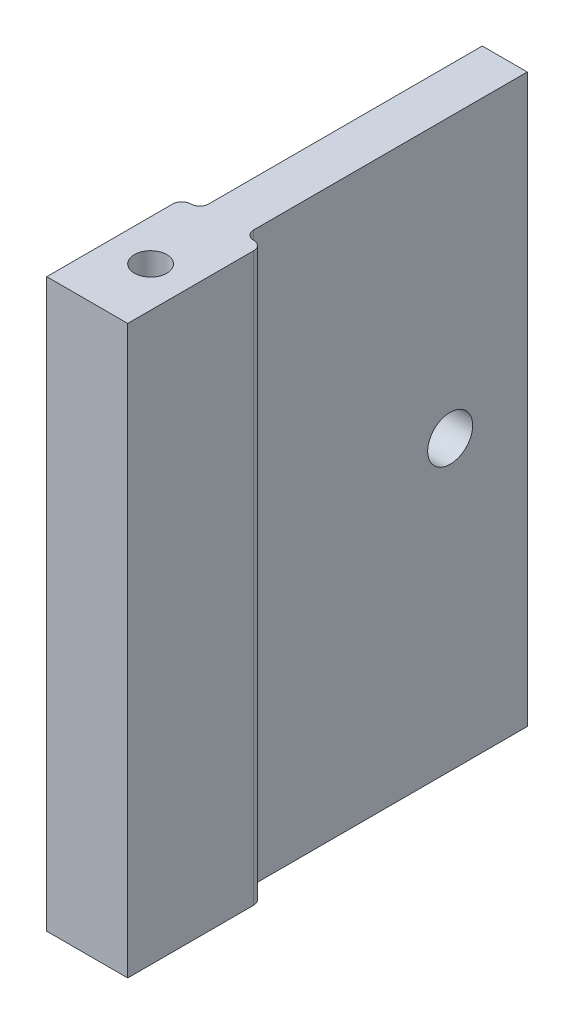
ISO-10303-21;
HEADER;
FILE_DESCRIPTION(('STEP AP214'),'2;1');
FILE_NAME('part.step','',(''),(''),'','','');
FILE_SCHEMA(('AUTOMOTIVE_DESIGN { 1 0 10303 214 1 1 1 1 }'));
ENDSEC;
DATA;
#1=APPLICATION_CONTEXT('core data for automotive mechanical design processes');
#2=APPLICATION_PROTOCOL_DEFINITION('international standard','automotive_design',2000,#1);
#3=PRODUCT_CONTEXT('',#1,'mechanical');
#4=PRODUCT('Part','Part','',(#3));
#5=PRODUCT_RELATED_PRODUCT_CATEGORY('part','',(#4));
#6=PRODUCT_DEFINITION_FORMATION('','',#4);
#7=PRODUCT_DEFINITION_CONTEXT('part definition',#1,'design');
#8=PRODUCT_DEFINITION('design','',#6,#7);
#9=PRODUCT_DEFINITION_SHAPE('','',#8);
#10=(LENGTH_UNIT() NAMED_UNIT(*) SI_UNIT(.MILLI.,.METRE.));
#11=(NAMED_UNIT(*) PLANE_ANGLE_UNIT() SI_UNIT($,.RADIAN.));
#12=(NAMED_UNIT(*) SI_UNIT($,.STERADIAN.) SOLID_ANGLE_UNIT());
#13=UNCERTAINTY_MEASURE_WITH_UNIT(LENGTH_MEASURE(1.E-05),#10,'distance_accuracy_value','');
#14=(GEOMETRIC_REPRESENTATION_CONTEXT(3) GLOBAL_UNCERTAINTY_ASSIGNED_CONTEXT((#13)) GLOBAL_UNIT_ASSIGNED_CONTEXT((#10,
#11,#12)) REPRESENTATION_CONTEXT('',''));
#15=CARTESIAN_POINT('',(0.,0.,0.));
#16=DIRECTION('',(0.,0.,1.));
#17=DIRECTION('',(1.,0.,0.));
#18=AXIS2_PLACEMENT_3D('',#15,#16,#17);
#19=CARTESIAN_POINT('',(0.,0.,-31.402624733886));
#20=DIRECTION('',(0.,0.,1.));
#21=DIRECTION('',(1.,0.,0.));
#22=AXIS2_PLACEMENT_3D('',#19,#20,#21);
#23=PLANE('',#22);
#24=DIRECTION('',(1.,0.,0.));
#25=VECTOR('',#24,1.);
#26=CARTESIAN_POINT('',(-14.0429447852761,-42.0644171779141,-31.402624733886));
#27=LINE('',#26,#25);
#28=CARTESIAN_POINT('',(-12.0429447852761,-42.0644171779141,-31.402624733886));
#29=VERTEX_POINT('',#28);
#30=CARTESIAN_POINT('',(-7.04294478527608,-42.0644171779141,-31.402624733886));
#31=VERTEX_POINT('',#30);
#32=EDGE_CURVE('E12',#29,#31,#27,.T.);
#33=ORIENTED_EDGE('',*,*,#32,.F.);
#34=DIRECTION('',(0.,-1.,0.));
#35=VECTOR('',#34,1.);
#36=CARTESIAN_POINT('',(-12.0429447852761,20.9355828220859,-31.402624733886));
#37=LINE('',#36,#35);
#38=CARTESIAN_POINT('',(-12.0429447852761,20.9355828220859,-31.402624733886));
#39=VERTEX_POINT('',#38);
#40=EDGE_CURVE('E201',#39,#29,#37,.T.);
#41=ORIENTED_EDGE('',*,*,#40,.F.);
#42=DIRECTION('',(-1.,0.,0.));
#43=VECTOR('',#42,1.);
#44=CARTESIAN_POINT('',(-14.0429447852761,20.9355828220859,-31.402624733886));
#45=LINE('',#44,#43);
#46=CARTESIAN_POINT('',(-7.04294478527607,20.9355828220859,-31.402624733886));
#47=VERTEX_POINT('',#46);
#48=EDGE_CURVE('E44',#47,#39,#45,.T.);
#49=ORIENTED_EDGE('',*,*,#48,.F.);
#50=DIRECTION('',(0.,1.,0.));
#51=VECTOR('',#50,1.);
#52=CARTESIAN_POINT('',(-7.04294478527607,20.9355828220859,-31.402624733886));
#53=LINE('',#52,#51);
#54=EDGE_CURVE('E39',#31,#47,#53,.T.);
#55=ORIENTED_EDGE('',*,*,#54,.F.);
#56=EDGE_LOOP('',(#33,#41,#49,#55));
#57=FACE_BOUND('',#56,.T.);
#58=ADVANCED_FACE('F36',(#57),#23,.F.);
#59=CARTESIAN_POINT('',(-6.04294478527608,20.9355828220859,0.999999999999999));
#60=DIRECTION('',(0.,1.,0.));
#61=DIRECTION('',(-1.,0.,0.));
#62=AXIS2_PLACEMENT_3D('',#59,#60,#61);
#63=CYLINDRICAL_SURFACE('',#62,1.);
#64=DIRECTION('',(0.,1.,0.));
#65=VECTOR('',#64,1.);
#66=CARTESIAN_POINT('',(-5.04294478527608,20.9355828220859,0.999999999999999));
#67=LINE('',#66,#65);
#68=CARTESIAN_POINT('',(-5.04294478527607,-42.0644171779141,0.999999999999999));
#69=VERTEX_POINT('',#68);
#70=CARTESIAN_POINT('',(-5.04294478527608,20.9355828220859,0.999999999999999));
#71=VERTEX_POINT('',#70);
#72=EDGE_CURVE('E189',#69,#71,#67,.T.);
#73=ORIENTED_EDGE('',*,*,#72,.F.);
#74=CARTESIAN_POINT('',(-6.04294478527607,-42.0644171779141,0.999999999999999));
#75=DIRECTION('',(0.,1.,0.));
#76=DIRECTION('',(0.,0.,1.));
#77=AXIS2_PLACEMENT_3D('',#74,#75,#76);
#78=CIRCLE('',#77,1.);
#79=CARTESIAN_POINT('',(-6.04294478527608,-42.0644171779141,0.));
#80=VERTEX_POINT('',#79);
#81=EDGE_CURVE('E192',#80,#69,#78,.F.);
#82=ORIENTED_EDGE('',*,*,#81,.F.);
#83=DIRECTION('',(0.,1.,0.));
#84=VECTOR('',#83,1.);
#85=CARTESIAN_POINT('',(-6.04294478527607,0.,0.));
#86=LINE('',#85,#84);
#87=CARTESIAN_POINT('',(-6.04294478527607,20.9355828220859,0.));
#88=VERTEX_POINT('',#87);
#89=EDGE_CURVE('E120',#80,#88,#86,.T.);
#90=ORIENTED_EDGE('',*,*,#89,.T.);
#91=CARTESIAN_POINT('',(-6.04294478527608,20.9355828220859,0.999999999999999));
#92=DIRECTION('',(0.,-1.,0.));
#93=DIRECTION('',(1.,0.,0.));
#94=AXIS2_PLACEMENT_3D('',#91,#92,#93);
#95=CIRCLE('',#94,1.);
#96=EDGE_CURVE('E194',#71,#88,#95,.F.);
#97=ORIENTED_EDGE('',*,*,#96,.F.);
#98=EDGE_LOOP('',(#73,#82,#90,#97));
#99=FACE_BOUND('',#98,.T.);
#100=ADVANCED_FACE('F227',(#99),#63,.T.);
#101=CARTESIAN_POINT('',(-5.04294478527608,20.9355828220859,10.));
#102=DIRECTION('',(-1.,0.,0.));
#103=DIRECTION('',(0.,-1.,0.));
#104=AXIS2_PLACEMENT_3D('',#101,#102,#103);
#105=PLANE('',#104);
#106=DIRECTION('',(0.,0.,-1.));
#107=VECTOR('',#106,1.);
#108=CARTESIAN_POINT('',(-5.04294478527607,-42.0644171779141,10.));
#109=LINE('',#108,#107);
#110=CARTESIAN_POINT('',(-5.04294478527607,-42.0644171779141,15.));
#111=VERTEX_POINT('',#110);
#112=EDGE_CURVE('E121',#111,#69,#109,.T.);
#113=ORIENTED_EDGE('',*,*,#112,.T.);
#114=ORIENTED_EDGE('',*,*,#72,.T.);
#115=DIRECTION('',(0.,0.,-1.));
#116=VECTOR('',#115,1.);
#117=CARTESIAN_POINT('',(-5.04294478527608,20.9355828220859,10.));
#118=LINE('',#117,#116);
#119=CARTESIAN_POINT('',(-5.04294478527607,20.9355828220859,15.));
#120=VERTEX_POINT('',#119);
#121=EDGE_CURVE('E162',#120,#71,#118,.T.);
#122=ORIENTED_EDGE('',*,*,#121,.F.);
#123=DIRECTION('',(0.,1.,0.));
#124=VECTOR('',#123,1.);
#125=CARTESIAN_POINT('',(-5.04294478527607,20.9355828220859,15.));
#126=LINE('',#125,#124);
#127=EDGE_CURVE('E131',#111,#120,#126,.T.);
#128=ORIENTED_EDGE('',*,*,#127,.F.);
#129=EDGE_LOOP('',(#113,#114,#122,#128));
#130=FACE_BOUND('',#129,.T.);
#131=ADVANCED_FACE('F229',(#130),#105,.F.);
#132=CARTESIAN_POINT('',(-14.0429447852761,20.9355828220859,10.));
#133=DIRECTION('',(1.,0.,0.));
#134=DIRECTION('',(0.,0.,-1.));
#135=AXIS2_PLACEMENT_3D('',#132,#133,#134);
#136=PLANE('',#135);
#137=DIRECTION('',(0.,0.,-1.));
#138=VECTOR('',#137,1.);
#139=CARTESIAN_POINT('',(-14.0429447852761,20.9355828220859,10.));
#140=LINE('',#139,#138);
#141=CARTESIAN_POINT('',(-14.0429447852761,20.9355828220859,15.));
#142=VERTEX_POINT('',#141);
#143=CARTESIAN_POINT('',(-14.0429447852761,20.9355828220859,0.999999999999999));
#144=VERTEX_POINT('',#143);
#145=EDGE_CURVE('E160',#142,#144,#140,.T.);
#146=ORIENTED_EDGE('',*,*,#145,.T.);
#147=DIRECTION('',(0.,-1.,0.));
#148=VECTOR('',#147,1.);
#149=CARTESIAN_POINT('',(-14.0429447852761,20.9355828220859,0.999999999999999));
#150=LINE('',#149,#148);
#151=CARTESIAN_POINT('',(-14.0429447852761,-42.0644171779141,0.999999999999999));
#152=VERTEX_POINT('',#151);
#153=EDGE_CURVE('E118',#144,#152,#150,.T.);
#154=ORIENTED_EDGE('',*,*,#153,.T.);
#155=DIRECTION('',(0.,0.,-1.));
#156=VECTOR('',#155,1.);
#157=CARTESIAN_POINT('',(-14.0429447852761,-42.0644171779141,10.));
#158=LINE('',#157,#156);
#159=CARTESIAN_POINT('',(-14.0429447852761,-42.0644171779141,15.));
#160=VERTEX_POINT('',#159);
#161=EDGE_CURVE('E111',#160,#152,#158,.T.);
#162=ORIENTED_EDGE('',*,*,#161,.F.);
#163=DIRECTION('',(0.,-1.,0.));
#164=VECTOR('',#163,1.);
#165=CARTESIAN_POINT('',(-14.0429447852761,20.9355828220859,15.));
#166=LINE('',#165,#164);
#167=EDGE_CURVE('E116',#142,#160,#166,.T.);
#168=ORIENTED_EDGE('',*,*,#167,.F.);
#169=EDGE_LOOP('',(#146,#154,#162,#168));
#170=FACE_BOUND('',#169,.T.);
#171=ADVANCED_FACE('F114',(#170),#136,.F.);
#172=CARTESIAN_POINT('',(-13.0429447852761,20.9355828220859,0.999999999999999));
#173=DIRECTION('',(0.,-1.,0.));
#174=DIRECTION('',(0.,0.,-1.));
#175=AXIS2_PLACEMENT_3D('',#172,#173,#174);
#176=CYLINDRICAL_SURFACE('',#175,1.);
#177=ORIENTED_EDGE('',*,*,#153,.F.);
#178=CARTESIAN_POINT('',(-13.0429447852761,20.9355828220859,0.999999999999999));
#179=DIRECTION('',(0.,-1.,0.));
#180=DIRECTION('',(1.,0.,0.));
#181=AXIS2_PLACEMENT_3D('',#178,#179,#180);
#182=CIRCLE('',#181,1.);
#183=CARTESIAN_POINT('',(-13.0429447852761,20.9355828220859,0.));
#184=VERTEX_POINT('',#183);
#185=EDGE_CURVE('E197',#184,#144,#182,.F.);
#186=ORIENTED_EDGE('',*,*,#185,.F.);
#187=DIRECTION('',(0.,-1.,0.));
#188=VECTOR('',#187,1.);
#189=CARTESIAN_POINT('',(-13.0429447852761,0.,0.));
#190=LINE('',#189,#188);
#191=CARTESIAN_POINT('',(-13.0429447852761,-42.0644171779141,0.));
#192=VERTEX_POINT('',#191);
#193=EDGE_CURVE('E177',#184,#192,#190,.T.);
#194=ORIENTED_EDGE('',*,*,#193,.T.);
#195=CARTESIAN_POINT('',(-13.0429447852761,-42.0644171779141,0.999999999999999));
#196=DIRECTION('',(0.,1.,0.));
#197=DIRECTION('',(0.,0.,1.));
#198=AXIS2_PLACEMENT_3D('',#195,#196,#197);
#199=CIRCLE('',#198,1.);
#200=EDGE_CURVE('E199',#152,#192,#199,.F.);
#201=ORIENTED_EDGE('',*,*,#200,.F.);
#202=EDGE_LOOP('',(#177,#186,#194,#201));
#203=FACE_BOUND('',#202,.T.);
#204=ADVANCED_FACE('F218',(#203),#176,.T.);
#205=CARTESIAN_POINT('',(-6.04294478527607,0.,-1.));
#206=DIRECTION('',(0.,-1.,0.));
#207=DIRECTION('',(1.,0.,0.));
#208=AXIS2_PLACEMENT_3D('',#205,#206,#207);
#209=CYLINDRICAL_SURFACE('',#208,1.);
#210=ORIENTED_EDGE('',*,*,#89,.F.);
#211=CARTESIAN_POINT('',(-6.04294478527608,-42.0644171779141,-1.));
#212=DIRECTION('',(0.,1.,0.));
#213=DIRECTION('',(0.,0.,1.));
#214=AXIS2_PLACEMENT_3D('',#211,#212,#213);
#215=CIRCLE('',#214,1.);
#216=CARTESIAN_POINT('',(-7.04294478527608,-42.0644171779141,-1.));
#217=VERTEX_POINT('',#216);
#218=EDGE_CURVE('E171',#80,#217,#215,.F.);
#219=ORIENTED_EDGE('',*,*,#218,.T.);
#220=DIRECTION('',(0.,1.,0.));
#221=VECTOR('',#220,1.);
#222=CARTESIAN_POINT('',(-7.04294478527607,0.,-1.));
#223=LINE('',#222,#221);
#224=CARTESIAN_POINT('',(-7.04294478527607,20.9355828220859,-1.));
#225=VERTEX_POINT('',#224);
#226=EDGE_CURVE('E168',#225,#217,#223,.F.);
#227=ORIENTED_EDGE('',*,*,#226,.F.);
#228=CARTESIAN_POINT('',(-6.04294478527607,20.9355828220859,-1.));
#229=DIRECTION('',(0.,-1.,0.));
#230=DIRECTION('',(1.,0.,0.));
#231=AXIS2_PLACEMENT_3D('',#228,#229,#230);
#232=CIRCLE('',#231,1.);
#233=EDGE_CURVE('E174',#225,#88,#232,.F.);
#234=ORIENTED_EDGE('',*,*,#233,.T.);
#235=EDGE_LOOP('',(#210,#219,#227,#234));
#236=FACE_BOUND('',#235,.T.);
#237=ADVANCED_FACE('F224',(#236),#209,.F.);
#238=CARTESIAN_POINT('',(-13.0429447852761,0.,-1.));
#239=DIRECTION('',(0.,1.,0.));
#240=DIRECTION('',(-1.,0.,0.));
#241=AXIS2_PLACEMENT_3D('',#238,#239,#240);
#242=CYLINDRICAL_SURFACE('',#241,1.);
#243=ORIENTED_EDGE('',*,*,#193,.F.);
#244=CARTESIAN_POINT('',(-13.0429447852761,20.9355828220859,-1.));
#245=DIRECTION('',(0.,-1.,0.));
#246=DIRECTION('',(1.,0.,0.));
#247=AXIS2_PLACEMENT_3D('',#244,#245,#246);
#248=CIRCLE('',#247,1.);
#249=CARTESIAN_POINT('',(-12.0429447852761,20.9355828220859,-1.));
#250=VERTEX_POINT('',#249);
#251=EDGE_CURVE('E183',#184,#250,#248,.F.);
#252=ORIENTED_EDGE('',*,*,#251,.T.);
#253=DIRECTION('',(0.,-1.,0.));
#254=VECTOR('',#253,1.);
#255=CARTESIAN_POINT('',(-12.0429447852761,0.,-1.));
#256=LINE('',#255,#254);
#257=CARTESIAN_POINT('',(-12.0429447852761,-42.0644171779141,-1.));
#258=VERTEX_POINT('',#257);
#259=EDGE_CURVE('E180',#258,#250,#256,.F.);
#260=ORIENTED_EDGE('',*,*,#259,.F.);
#261=CARTESIAN_POINT('',(-13.0429447852761,-42.0644171779141,-1.));
#262=DIRECTION('',(0.,1.,0.));
#263=DIRECTION('',(0.,0.,1.));
#264=AXIS2_PLACEMENT_3D('',#261,#262,#263);
#265=CIRCLE('',#264,1.);
#266=EDGE_CURVE('E186',#258,#192,#265,.F.);
#267=ORIENTED_EDGE('',*,*,#266,.T.);
#268=EDGE_LOOP('',(#243,#252,#260,#267));
#269=FACE_BOUND('',#268,.T.);
#270=ADVANCED_FACE('F216',(#269),#242,.F.);
#271=CARTESIAN_POINT('',(-14.0429447852761,-42.0644171779141,10.));
#272=DIRECTION('',(0.,1.,0.));
#273=DIRECTION('',(0.,0.,1.));
#274=AXIS2_PLACEMENT_3D('',#271,#272,#273);
#275=PLANE('',#274);
#276=CARTESIAN_POINT('',(-9.5,-42.0644171779141,8.));
#277=DIRECTION('',(0.,-1.,0.));
#278=DIRECTION('',(0.,0.,-1.));
#279=AXIS2_PLACEMENT_3D('',#276,#277,#278);
#280=CIRCLE('',#279,1.8);
#281=CARTESIAN_POINT('',(-9.5,-42.0644171779141,6.2));
#282=VERTEX_POINT('',#281);
#283=EDGE_CURVE('E267',#282,#282,#280,.T.);
#284=ORIENTED_EDGE('',*,*,#283,.F.);
#285=EDGE_LOOP('',(#284));
#286=FACE_BOUND('',#285,.T.);
#287=DIRECTION('',(0.,0.,1.));
#288=VECTOR('',#287,1.);
#289=CARTESIAN_POINT('',(-12.0429447852761,-42.0644171779141,-63.));
#290=LINE('',#289,#288);
#291=EDGE_CURVE('E156',#29,#258,#290,.T.);
#292=ORIENTED_EDGE('',*,*,#291,.F.);
#293=ORIENTED_EDGE('',*,*,#32,.T.);
#294=DIRECTION('',(0.,0.,1.));
#295=VECTOR('',#294,1.);
#296=CARTESIAN_POINT('',(-7.04294478527608,-42.0644171779141,-63.));
#297=LINE('',#296,#295);
#298=EDGE_CURVE('E158',#31,#217,#297,.T.);
#299=ORIENTED_EDGE('',*,*,#298,.T.);
#300=ORIENTED_EDGE('',*,*,#218,.F.);
#301=ORIENTED_EDGE('',*,*,#81,.T.);
#302=ORIENTED_EDGE('',*,*,#112,.F.);
#303=DIRECTION('',(1.,0.,0.));
#304=VECTOR('',#303,1.);
#305=CARTESIAN_POINT('',(-14.0429447852761,-42.0644171779141,15.));
#306=LINE('',#305,#304);
#307=EDGE_CURVE('E124',#160,#111,#306,.T.);
#308=ORIENTED_EDGE('',*,*,#307,.F.);
#309=ORIENTED_EDGE('',*,*,#161,.T.);
#310=ORIENTED_EDGE('',*,*,#200,.T.);
#311=ORIENTED_EDGE('',*,*,#266,.F.);
#312=EDGE_LOOP('',(#292,#293,#299,#300,#301,#302,#308,#309,#310,#311));
#313=FACE_BOUND('',#312,.T.);
#314=ADVANCED_FACE('F126',(#286,#313),#275,.F.);
#315=CARTESIAN_POINT('',(-14.0429447852761,20.9355828220859,10.));
#316=DIRECTION('',(0.,-1.,0.));
#317=DIRECTION('',(1.,0.,0.));
#318=AXIS2_PLACEMENT_3D('',#315,#316,#317);
#319=PLANE('',#318);
#320=CARTESIAN_POINT('',(-9.49999999999999,20.9355828220859,8.));
#321=DIRECTION('',(0.,1.,0.));
#322=DIRECTION('',(-1.,0.,0.));
#323=AXIS2_PLACEMENT_3D('',#320,#321,#322);
#324=CIRCLE('',#323,1.8);
#325=CARTESIAN_POINT('',(-11.3,20.9355828220859,8.));
#326=VERTEX_POINT('',#325);
#327=EDGE_CURVE('E140',#326,#326,#324,.T.);
#328=ORIENTED_EDGE('',*,*,#327,.F.);
#329=EDGE_LOOP('',(#328));
#330=FACE_BOUND('',#329,.T.);
#331=DIRECTION('',(0.,0.,1.));
#332=VECTOR('',#331,1.);
#333=CARTESIAN_POINT('',(-7.04294478527607,20.9355828220859,-63.));
#334=LINE('',#333,#332);
#335=EDGE_CURVE('E152',#47,#225,#334,.T.);
#336=ORIENTED_EDGE('',*,*,#335,.F.);
#337=ORIENTED_EDGE('',*,*,#48,.T.);
#338=DIRECTION('',(0.,0.,1.));
#339=VECTOR('',#338,1.);
#340=CARTESIAN_POINT('',(-12.0429447852761,20.9355828220859,-63.));
#341=LINE('',#340,#339);
#342=EDGE_CURVE('E154',#39,#250,#341,.T.);
#343=ORIENTED_EDGE('',*,*,#342,.T.);
#344=ORIENTED_EDGE('',*,*,#251,.F.);
#345=ORIENTED_EDGE('',*,*,#185,.T.);
#346=ORIENTED_EDGE('',*,*,#145,.F.);
#347=DIRECTION('',(-1.,0.,0.));
#348=VECTOR('',#347,1.);
#349=CARTESIAN_POINT('',(-14.0429447852761,20.9355828220859,15.));
#350=LINE('',#349,#348);
#351=EDGE_CURVE('E136',#120,#142,#350,.T.);
#352=ORIENTED_EDGE('',*,*,#351,.F.);
#353=ORIENTED_EDGE('',*,*,#121,.T.);
#354=ORIENTED_EDGE('',*,*,#96,.T.);
#355=ORIENTED_EDGE('',*,*,#233,.F.);
#356=EDGE_LOOP('',(#336,#337,#343,#344,#345,#346,#352,#353,#354,#355));
#357=FACE_BOUND('',#356,.T.);
#358=ADVANCED_FACE('F206',(#330,#357),#319,.F.);
#359=CARTESIAN_POINT('',(-12.0429447852761,20.9355828220859,-63.));
#360=DIRECTION('',(1.,0.,0.));
#361=DIRECTION('',(0.,1.,0.));
#362=AXIS2_PLACEMENT_3D('',#359,#360,#361);
#363=PLANE('',#362);
#364=CARTESIAN_POINT('',(-12.0429447852761,-10.0364110327114,-22.8353214239974));
#365=DIRECTION('',(1.,0.,0.));
#366=DIRECTION('',(0.,1.,0.));
#367=AXIS2_PLACEMENT_3D('',#364,#365,#366);
#368=CIRCLE('',#367,2.5);
#369=CARTESIAN_POINT('',(-12.0429447852761,-7.53641103271135,-22.8353214239974));
#370=VERTEX_POINT('',#369);
#371=EDGE_CURVE('E149',#370,#370,#368,.T.);
#372=ORIENTED_EDGE('',*,*,#371,.T.);
#373=EDGE_LOOP('',(#372));
#374=FACE_BOUND('',#373,.T.);
#375=ORIENTED_EDGE('',*,*,#342,.F.);
#376=ORIENTED_EDGE('',*,*,#40,.T.);
#377=ORIENTED_EDGE('',*,*,#291,.T.);
#378=ORIENTED_EDGE('',*,*,#259,.T.);
#379=EDGE_LOOP('',(#375,#376,#377,#378));
#380=FACE_BOUND('',#379,.T.);
#381=ADVANCED_FACE('F211',(#374,#380),#363,.F.);
#382=CARTESIAN_POINT('',(-7.04294478527607,20.9355828220859,-63.));
#383=DIRECTION('',(-1.,0.,0.));
#384=DIRECTION('',(0.,-1.,0.));
#385=AXIS2_PLACEMENT_3D('',#382,#383,#384);
#386=PLANE('',#385);
#387=CARTESIAN_POINT('',(-7.04294478527607,-10.0364110327114,-22.8353214239974));
#388=DIRECTION('',(1.,0.,0.));
#389=DIRECTION('',(0.,1.,0.));
#390=AXIS2_PLACEMENT_3D('',#387,#388,#389);
#391=CIRCLE('',#390,2.5);
#392=CARTESIAN_POINT('',(-7.04294478527607,-7.53641103271136,-22.8353214239974));
#393=VERTEX_POINT('',#392);
#394=EDGE_CURVE('E146',#393,#393,#391,.T.);
#395=ORIENTED_EDGE('',*,*,#394,.F.);
#396=EDGE_LOOP('',(#395));
#397=FACE_BOUND('',#396,.T.);
#398=ORIENTED_EDGE('',*,*,#298,.F.);
#399=ORIENTED_EDGE('',*,*,#54,.T.);
#400=ORIENTED_EDGE('',*,*,#335,.T.);
#401=ORIENTED_EDGE('',*,*,#226,.T.);
#402=EDGE_LOOP('',(#398,#399,#400,#401));
#403=FACE_BOUND('',#402,.T.);
#404=ADVANCED_FACE('F220',(#397,#403),#386,.F.);
#405=CARTESIAN_POINT('',(-30.0429447852761,-10.0364110327114,-22.8353214239974));
#406=DIRECTION('',(1.,0.,0.));
#407=DIRECTION('',(0.,1.,0.));
#408=AXIS2_PLACEMENT_3D('',#405,#406,#407);
#409=CYLINDRICAL_SURFACE('',#408,2.5);
#410=ORIENTED_EDGE('',*,*,#394,.T.);
#411=EDGE_LOOP('',(#410));
#412=FACE_BOUND('',#411,.T.);
#413=ORIENTED_EDGE('',*,*,#371,.F.);
#414=EDGE_LOOP('',(#413));
#415=FACE_BOUND('',#414,.T.);
#416=ADVANCED_FACE('F238',(#412,#415),#409,.F.);
#417=CARTESIAN_POINT('',(0.,0.,15.));
#418=DIRECTION('',(0.,0.,1.));
#419=DIRECTION('',(1.,0.,0.));
#420=AXIS2_PLACEMENT_3D('',#417,#418,#419);
#421=PLANE('',#420);
#422=ORIENTED_EDGE('',*,*,#167,.T.);
#423=ORIENTED_EDGE('',*,*,#307,.T.);
#424=ORIENTED_EDGE('',*,*,#127,.T.);
#425=ORIENTED_EDGE('',*,*,#351,.T.);
#426=EDGE_LOOP('',(#422,#423,#424,#425));
#427=FACE_BOUND('',#426,.T.);
#428=ADVANCED_FACE('F134',(#427),#421,.T.);
#429=CARTESIAN_POINT('',(-9.49999999999999,16.9355828220859,8.));
#430=DIRECTION('',(0.,1.,0.));
#431=DIRECTION('',(-1.,0.,0.));
#432=AXIS2_PLACEMENT_3D('',#429,#430,#431);
#433=CYLINDRICAL_SURFACE('',#432,1.8);
#434=CARTESIAN_POINT('',(-9.49999999999999,16.9355828220859,8.));
#435=DIRECTION('',(0.,1.,0.));
#436=DIRECTION('',(-1.,0.,0.));
#437=AXIS2_PLACEMENT_3D('',#434,#435,#436);
#438=CIRCLE('',#437,1.8);
#439=CARTESIAN_POINT('',(-11.3,16.9355828220859,8.));
#440=VERTEX_POINT('',#439);
#441=EDGE_CURVE('E137',#440,#440,#438,.T.);
#442=ORIENTED_EDGE('',*,*,#441,.F.);
#443=EDGE_LOOP('',(#442));
#444=FACE_BOUND('',#443,.T.);
#445=ORIENTED_EDGE('',*,*,#327,.T.);
#446=EDGE_LOOP('',(#445));
#447=FACE_BOUND('',#446,.T.);
#448=ADVANCED_FACE('F286',(#444,#447),#433,.F.);
#449=CARTESIAN_POINT('',(-9.49999999999999,16.9355828220859,8.));
#450=DIRECTION('',(0.,1.,0.));
#451=DIRECTION('',(-1.,0.,0.));
#452=AXIS2_PLACEMENT_3D('',#449,#450,#451);
#453=PLANE('',#452);
#454=ORIENTED_EDGE('',*,*,#441,.T.);
#455=EDGE_LOOP('',(#454));
#456=FACE_BOUND('',#455,.T.);
#457=ADVANCED_FACE('F278',(#456),#453,.T.);
#458=CARTESIAN_POINT('',(-9.5,-38.0644171779141,8.));
#459=DIRECTION('',(0.,-1.,0.));
#460=DIRECTION('',(0.,0.,-1.));
#461=AXIS2_PLACEMENT_3D('',#458,#459,#460);
#462=CYLINDRICAL_SURFACE('',#461,1.8);
#463=CARTESIAN_POINT('',(-9.5,-38.0644171779141,8.));
#464=DIRECTION('',(0.,-1.,0.));
#465=DIRECTION('',(0.,0.,-1.));
#466=AXIS2_PLACEMENT_3D('',#463,#464,#465);
#467=CIRCLE('',#466,1.8);
#468=CARTESIAN_POINT('',(-9.5,-38.0644171779141,6.2));
#469=VERTEX_POINT('',#468);
#470=EDGE_CURVE('E265',#469,#469,#467,.T.);
#471=ORIENTED_EDGE('',*,*,#470,.F.);
#472=EDGE_LOOP('',(#471));
#473=FACE_BOUND('',#472,.T.);
#474=ORIENTED_EDGE('',*,*,#283,.T.);
#475=EDGE_LOOP('',(#474));
#476=FACE_BOUND('',#475,.T.);
#477=ADVANCED_FACE('F275',(#473,#476),#462,.F.);
#478=CARTESIAN_POINT('',(-9.5,-38.0644171779141,8.));
#479=DIRECTION('',(0.,-1.,0.));
#480=DIRECTION('',(0.,0.,-1.));
#481=AXIS2_PLACEMENT_3D('',#478,#479,#480);
#482=PLANE('',#481);
#483=ORIENTED_EDGE('',*,*,#470,.T.);
#484=EDGE_LOOP('',(#483));
#485=FACE_BOUND('',#484,.T.);
#486=ADVANCED_FACE('F277',(#485),#482,.T.);
#487=CLOSED_SHELL('',(#58,#100,#131,#171,#204,#237,#270,#314,#358,#381,#404,#416,#428,#448,#457,
#477,#486));
#488=MANIFOLD_SOLID_BREP('B2',#487);
#489=ADVANCED_BREP_SHAPE_REPRESENTATION('',(#18,#488),#14);
#490=SHAPE_DEFINITION_REPRESENTATION(#9,#489);
ENDSEC;
END-ISO-10303-21;
